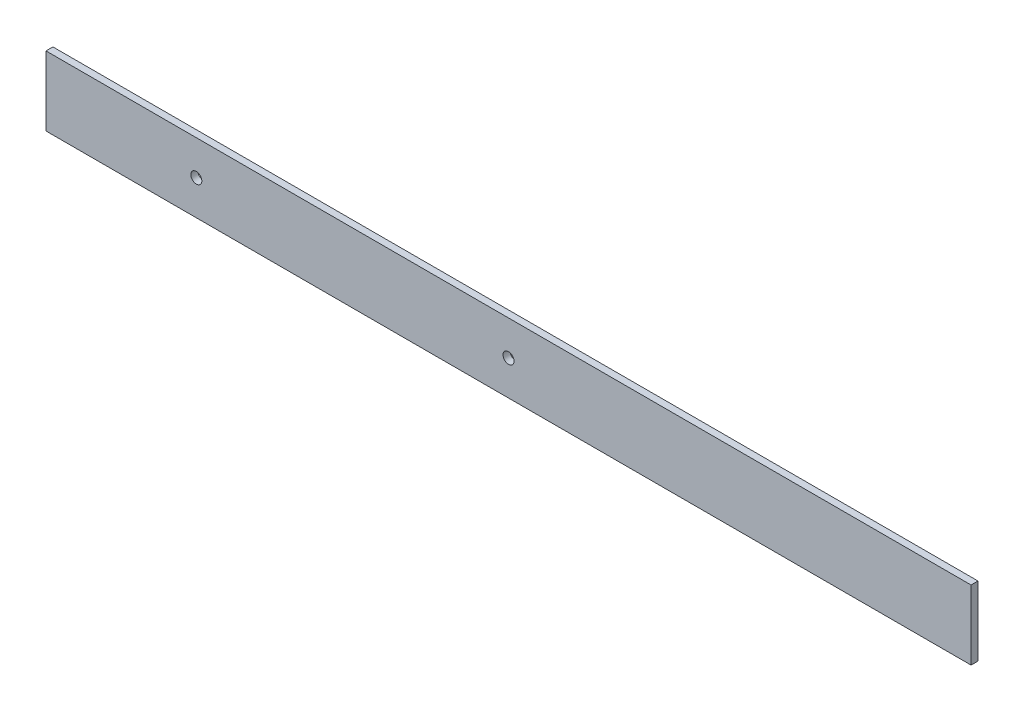
ISO-10303-21;
HEADER;
FILE_DESCRIPTION(('STEP AP214'),'2;1');
FILE_NAME('part.step','',(''),(''),'','','');
FILE_SCHEMA(('AUTOMOTIVE_DESIGN { 1 0 10303 214 1 1 1 1 }'));
ENDSEC;
DATA;
#1=APPLICATION_CONTEXT('core data for automotive mechanical design processes');
#2=APPLICATION_PROTOCOL_DEFINITION('international standard','automotive_design',2000,#1);
#3=PRODUCT_CONTEXT('',#1,'mechanical');
#4=PRODUCT('Part','Part','',(#3));
#5=PRODUCT_RELATED_PRODUCT_CATEGORY('part','',(#4));
#6=PRODUCT_DEFINITION_FORMATION('','',#4);
#7=PRODUCT_DEFINITION_CONTEXT('part definition',#1,'design');
#8=PRODUCT_DEFINITION('design','',#6,#7);
#9=PRODUCT_DEFINITION_SHAPE('','',#8);
#10=(LENGTH_UNIT() NAMED_UNIT(*) SI_UNIT(.MILLI.,.METRE.));
#11=(NAMED_UNIT(*) PLANE_ANGLE_UNIT() SI_UNIT($,.RADIAN.));
#12=(NAMED_UNIT(*) SI_UNIT($,.STERADIAN.) SOLID_ANGLE_UNIT());
#13=UNCERTAINTY_MEASURE_WITH_UNIT(LENGTH_MEASURE(1.E-05),#10,'distance_accuracy_value','');
#14=(GEOMETRIC_REPRESENTATION_CONTEXT(3) GLOBAL_UNCERTAINTY_ASSIGNED_CONTEXT((#13)) GLOBAL_UNIT_ASSIGNED_CONTEXT((#10,
#11,#12)) REPRESENTATION_CONTEXT('',''));
#15=CARTESIAN_POINT('',(0.,0.,0.));
#16=DIRECTION('',(0.,0.,1.));
#17=DIRECTION('',(1.,0.,0.));
#18=AXIS2_PLACEMENT_3D('',#15,#16,#17);
#19=CARTESIAN_POINT('',(0.,0.,3.));
#20=DIRECTION('',(0.,0.,1.));
#21=DIRECTION('',(1.,0.,0.));
#22=AXIS2_PLACEMENT_3D('',#19,#20,#21);
#23=PLANE('',#22);
#24=CARTESIAN_POINT('',(-135.,0.,3.));
#25=DIRECTION('',(0.,0.,1.));
#26=DIRECTION('',(1.,0.,0.));
#27=AXIS2_PLACEMENT_3D('',#24,#25,#26);
#28=CIRCLE('',#27,2.38125000000001);
#29=CARTESIAN_POINT('',(-132.61875,0.,3.));
#30=VERTEX_POINT('',#29);
#31=EDGE_CURVE('E116',#30,#30,#28,.T.);
#32=ORIENTED_EDGE('',*,*,#31,.F.);
#33=EDGE_LOOP('',(#32));
#34=FACE_BOUND('',#33,.T.);
#35=DIRECTION('',(0.,1.,0.));
#36=VECTOR('',#35,1.);
#37=CARTESIAN_POINT('',(200.,15.,3.));
#38=LINE('',#37,#36);
#39=CARTESIAN_POINT('',(200.,-15.,3.));
#40=VERTEX_POINT('',#39);
#41=CARTESIAN_POINT('',(200.,15.,3.));
#42=VERTEX_POINT('',#41);
#43=EDGE_CURVE('E86',#40,#42,#38,.T.);
#44=ORIENTED_EDGE('',*,*,#43,.T.);
#45=DIRECTION('',(-1.,0.,0.));
#46=VECTOR('',#45,1.);
#47=CARTESIAN_POINT('',(-200.,15.,3.));
#48=LINE('',#47,#46);
#49=CARTESIAN_POINT('',(-200.,15.,3.));
#50=VERTEX_POINT('',#49);
#51=EDGE_CURVE('E81',#42,#50,#48,.T.);
#52=ORIENTED_EDGE('',*,*,#51,.T.);
#53=DIRECTION('',(0.,-1.,0.));
#54=VECTOR('',#53,1.);
#55=CARTESIAN_POINT('',(-200.,15.,3.));
#56=LINE('',#55,#54);
#57=CARTESIAN_POINT('',(-200.,-15.,3.));
#58=VERTEX_POINT('',#57);
#59=EDGE_CURVE('E84',#50,#58,#56,.T.);
#60=ORIENTED_EDGE('',*,*,#59,.T.);
#61=DIRECTION('',(1.,0.,0.));
#62=VECTOR('',#61,1.);
#63=CARTESIAN_POINT('',(-200.,-15.,3.));
#64=LINE('',#63,#62);
#65=EDGE_CURVE('E51',#58,#40,#64,.T.);
#66=ORIENTED_EDGE('',*,*,#65,.T.);
#67=EDGE_LOOP('',(#44,#52,#60,#66));
#68=FACE_BOUND('',#67,.T.);
#69=CARTESIAN_POINT('',(0.,0.,3.));
#70=DIRECTION('',(0.,0.,1.));
#71=DIRECTION('',(1.,0.,0.));
#72=AXIS2_PLACEMENT_3D('',#69,#70,#71);
#73=CIRCLE('',#72,2.38125);
#74=CARTESIAN_POINT('',(2.38124999999994,0.,3.));
#75=VERTEX_POINT('',#74);
#76=EDGE_CURVE('E101',#75,#75,#73,.T.);
#77=ORIENTED_EDGE('',*,*,#76,.F.);
#78=EDGE_LOOP('',(#77));
#79=FACE_BOUND('',#78,.T.);
#80=ADVANCED_FACE('F34',(#34,#68,#79),#23,.T.);
#81=CARTESIAN_POINT('',(0.,0.,0.));
#82=DIRECTION('',(0.,0.,1.));
#83=DIRECTION('',(1.,0.,0.));
#84=AXIS2_PLACEMENT_3D('',#81,#82,#83);
#85=PLANE('',#84);
#86=CARTESIAN_POINT('',(-135.,0.,0.));
#87=DIRECTION('',(0.,0.,1.));
#88=DIRECTION('',(1.,0.,0.));
#89=AXIS2_PLACEMENT_3D('',#86,#87,#88);
#90=CIRCLE('',#89,2.38125000000001);
#91=CARTESIAN_POINT('',(-132.61875,0.,0.));
#92=VERTEX_POINT('',#91);
#93=EDGE_CURVE('E119',#92,#92,#90,.T.);
#94=ORIENTED_EDGE('',*,*,#93,.T.);
#95=EDGE_LOOP('',(#94));
#96=FACE_BOUND('',#95,.T.);
#97=DIRECTION('',(0.,1.,0.));
#98=VECTOR('',#97,1.);
#99=CARTESIAN_POINT('',(200.,15.,0.));
#100=LINE('',#99,#98);
#101=CARTESIAN_POINT('',(200.,-15.,0.));
#102=VERTEX_POINT('',#101);
#103=CARTESIAN_POINT('',(200.,15.,0.));
#104=VERTEX_POINT('',#103);
#105=EDGE_CURVE('E98',#102,#104,#100,.T.);
#106=ORIENTED_EDGE('',*,*,#105,.F.);
#107=DIRECTION('',(1.,0.,0.));
#108=VECTOR('',#107,1.);
#109=CARTESIAN_POINT('',(-200.,-15.,0.));
#110=LINE('',#109,#108);
#111=CARTESIAN_POINT('',(-200.,-15.,0.));
#112=VERTEX_POINT('',#111);
#113=EDGE_CURVE('E74',#112,#102,#110,.T.);
#114=ORIENTED_EDGE('',*,*,#113,.F.);
#115=DIRECTION('',(0.,-1.,0.));
#116=VECTOR('',#115,1.);
#117=CARTESIAN_POINT('',(-200.,15.,0.));
#118=LINE('',#117,#116);
#119=CARTESIAN_POINT('',(-200.,15.,0.));
#120=VERTEX_POINT('',#119);
#121=EDGE_CURVE('E68',#120,#112,#118,.T.);
#122=ORIENTED_EDGE('',*,*,#121,.F.);
#123=DIRECTION('',(-1.,0.,0.));
#124=VECTOR('',#123,1.);
#125=CARTESIAN_POINT('',(-200.,15.,0.));
#126=LINE('',#125,#124);
#127=EDGE_CURVE('E90',#104,#120,#126,.T.);
#128=ORIENTED_EDGE('',*,*,#127,.F.);
#129=EDGE_LOOP('',(#106,#114,#122,#128));
#130=FACE_BOUND('',#129,.T.);
#131=CARTESIAN_POINT('',(0.,0.,0.));
#132=DIRECTION('',(0.,0.,1.));
#133=DIRECTION('',(1.,0.,0.));
#134=AXIS2_PLACEMENT_3D('',#131,#132,#133);
#135=CIRCLE('',#134,2.38125);
#136=CARTESIAN_POINT('',(2.38124999999994,0.,0.));
#137=VERTEX_POINT('',#136);
#138=EDGE_CURVE('E113',#137,#137,#135,.T.);
#139=ORIENTED_EDGE('',*,*,#138,.T.);
#140=EDGE_LOOP('',(#139));
#141=FACE_BOUND('',#140,.T.);
#142=ADVANCED_FACE('F109',(#96,#130,#141),#85,.F.);
#143=CARTESIAN_POINT('',(200.,15.,3.));
#144=DIRECTION('',(-1.,0.,0.));
#145=DIRECTION('',(0.,0.,1.));
#146=AXIS2_PLACEMENT_3D('',#143,#144,#145);
#147=PLANE('',#146);
#148=ORIENTED_EDGE('',*,*,#105,.T.);
#149=DIRECTION('',(0.,0.,-1.));
#150=VECTOR('',#149,1.);
#151=CARTESIAN_POINT('',(200.,15.,3.));
#152=LINE('',#151,#150);
#153=EDGE_CURVE('E11',#42,#104,#152,.T.);
#154=ORIENTED_EDGE('',*,*,#153,.F.);
#155=ORIENTED_EDGE('',*,*,#43,.F.);
#156=DIRECTION('',(0.,0.,-1.));
#157=VECTOR('',#156,1.);
#158=CARTESIAN_POINT('',(200.,-15.,3.));
#159=LINE('',#158,#157);
#160=EDGE_CURVE('E94',#40,#102,#159,.T.);
#161=ORIENTED_EDGE('',*,*,#160,.T.);
#162=EDGE_LOOP('',(#148,#154,#155,#161));
#163=FACE_BOUND('',#162,.T.);
#164=ADVANCED_FACE('F36',(#163),#147,.F.);
#165=CARTESIAN_POINT('',(-200.,15.,3.));
#166=DIRECTION('',(0.,-1.,0.));
#167=DIRECTION('',(0.,0.,-1.));
#168=AXIS2_PLACEMENT_3D('',#165,#166,#167);
#169=PLANE('',#168);
#170=ORIENTED_EDGE('',*,*,#127,.T.);
#171=DIRECTION('',(0.,0.,-1.));
#172=VECTOR('',#171,1.);
#173=CARTESIAN_POINT('',(-200.,15.,3.));
#174=LINE('',#173,#172);
#175=EDGE_CURVE('E43',#50,#120,#174,.T.);
#176=ORIENTED_EDGE('',*,*,#175,.F.);
#177=ORIENTED_EDGE('',*,*,#51,.F.);
#178=ORIENTED_EDGE('',*,*,#153,.T.);
#179=EDGE_LOOP('',(#170,#176,#177,#178));
#180=FACE_BOUND('',#179,.T.);
#181=ADVANCED_FACE('F89',(#180),#169,.F.);
#182=CARTESIAN_POINT('',(-200.,15.,3.));
#183=DIRECTION('',(1.,0.,0.));
#184=DIRECTION('',(0.,0.,-1.));
#185=AXIS2_PLACEMENT_3D('',#182,#183,#184);
#186=PLANE('',#185);
#187=ORIENTED_EDGE('',*,*,#121,.T.);
#188=DIRECTION('',(0.,0.,-1.));
#189=VECTOR('',#188,1.);
#190=CARTESIAN_POINT('',(-200.,-15.,3.));
#191=LINE('',#190,#189);
#192=EDGE_CURVE('E91',#58,#112,#191,.T.);
#193=ORIENTED_EDGE('',*,*,#192,.F.);
#194=ORIENTED_EDGE('',*,*,#59,.F.);
#195=ORIENTED_EDGE('',*,*,#175,.T.);
#196=EDGE_LOOP('',(#187,#193,#194,#195));
#197=FACE_BOUND('',#196,.T.);
#198=ADVANCED_FACE('F92',(#197),#186,.F.);
#199=CARTESIAN_POINT('',(-200.,-15.,3.));
#200=DIRECTION('',(0.,1.,0.));
#201=DIRECTION('',(0.,0.,1.));
#202=AXIS2_PLACEMENT_3D('',#199,#200,#201);
#203=PLANE('',#202);
#204=ORIENTED_EDGE('',*,*,#113,.T.);
#205=ORIENTED_EDGE('',*,*,#160,.F.);
#206=ORIENTED_EDGE('',*,*,#65,.F.);
#207=ORIENTED_EDGE('',*,*,#192,.T.);
#208=EDGE_LOOP('',(#204,#205,#206,#207));
#209=FACE_BOUND('',#208,.T.);
#210=ADVANCED_FACE('F106',(#209),#203,.F.);
#211=CARTESIAN_POINT('',(0.,0.,3.));
#212=DIRECTION('',(0.,0.,-1.));
#213=DIRECTION('',(-1.,0.,0.));
#214=AXIS2_PLACEMENT_3D('',#211,#212,#213);
#215=CYLINDRICAL_SURFACE('',#214,2.38125);
#216=ORIENTED_EDGE('',*,*,#76,.T.);
#217=EDGE_LOOP('',(#216));
#218=FACE_BOUND('',#217,.T.);
#219=ORIENTED_EDGE('',*,*,#138,.F.);
#220=EDGE_LOOP('',(#219));
#221=FACE_BOUND('',#220,.T.);
#222=ADVANCED_FACE('F136',(#218,#221),#215,.F.);
#223=CARTESIAN_POINT('',(-135.,0.,3.));
#224=DIRECTION('',(0.,0.,-1.));
#225=DIRECTION('',(-1.,0.,0.));
#226=AXIS2_PLACEMENT_3D('',#223,#224,#225);
#227=CYLINDRICAL_SURFACE('',#226,2.38125000000001);
#228=ORIENTED_EDGE('',*,*,#31,.T.);
#229=EDGE_LOOP('',(#228));
#230=FACE_BOUND('',#229,.T.);
#231=ORIENTED_EDGE('',*,*,#93,.F.);
#232=EDGE_LOOP('',(#231));
#233=FACE_BOUND('',#232,.T.);
#234=ADVANCED_FACE('F125',(#230,#233),#227,.F.);
#235=CLOSED_SHELL('',(#80,#142,#164,#181,#198,#210,#222,#234));
#236=MANIFOLD_SOLID_BREP('B2',#235);
#237=ADVANCED_BREP_SHAPE_REPRESENTATION('',(#18,#236),#14);
#238=SHAPE_DEFINITION_REPRESENTATION(#9,#237);
ENDSEC;
END-ISO-10303-21;
